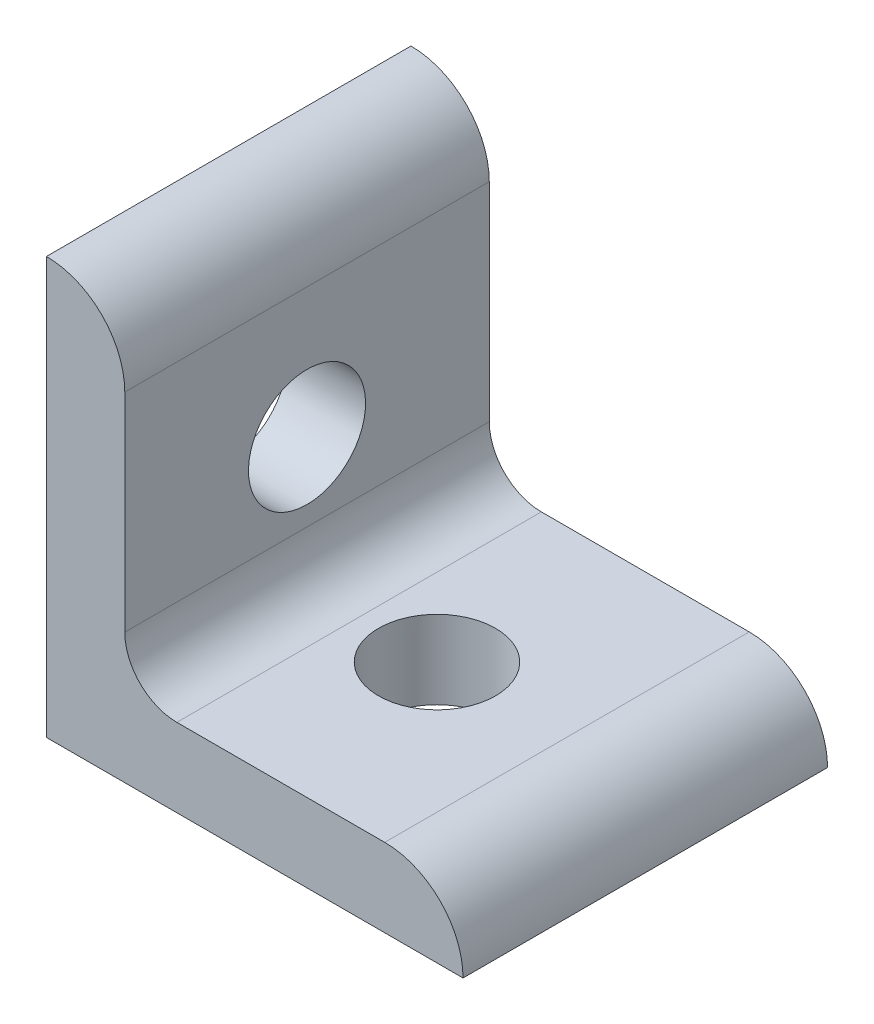
ISO-10303-21;
HEADER;
FILE_DESCRIPTION(('STEP AP214'),'2;1');
FILE_NAME('part.step','',(''),(''),'','','');
FILE_SCHEMA(('AUTOMOTIVE_DESIGN { 1 0 10303 214 1 1 1 1 }'));
ENDSEC;
DATA;
#1=APPLICATION_CONTEXT('core data for automotive mechanical design processes');
#2=APPLICATION_PROTOCOL_DEFINITION('international standard','automotive_design',2000,#1);
#3=PRODUCT_CONTEXT('',#1,'mechanical');
#4=PRODUCT('Part','Part','',(#3));
#5=PRODUCT_RELATED_PRODUCT_CATEGORY('part','',(#4));
#6=PRODUCT_DEFINITION_FORMATION('','',#4);
#7=PRODUCT_DEFINITION_CONTEXT('part definition',#1,'design');
#8=PRODUCT_DEFINITION('design','',#6,#7);
#9=PRODUCT_DEFINITION_SHAPE('','',#8);
#10=(LENGTH_UNIT() NAMED_UNIT(*) SI_UNIT(.MILLI.,.METRE.));
#11=(NAMED_UNIT(*) PLANE_ANGLE_UNIT() SI_UNIT($,.RADIAN.));
#12=(NAMED_UNIT(*) SI_UNIT($,.STERADIAN.) SOLID_ANGLE_UNIT());
#13=UNCERTAINTY_MEASURE_WITH_UNIT(LENGTH_MEASURE(1.E-05),#10,'distance_accuracy_value','');
#14=(GEOMETRIC_REPRESENTATION_CONTEXT(3) GLOBAL_UNCERTAINTY_ASSIGNED_CONTEXT((#13)) GLOBAL_UNIT_ASSIGNED_CONTEXT((#10,
#11,#12)) REPRESENTATION_CONTEXT('',''));
#15=CARTESIAN_POINT('',(0.,0.,0.));
#16=DIRECTION('',(0.,0.,1.));
#17=DIRECTION('',(1.,0.,0.));
#18=AXIS2_PLACEMENT_3D('',#15,#16,#17);
#19=CARTESIAN_POINT('',(4.7752,20.6248,11.1125));
#20=DIRECTION('',(-1.,0.,0.));
#21=DIRECTION('',(0.,-1.,0.));
#22=AXIS2_PLACEMENT_3D('',#19,#20,#21);
#23=PLANE('',#22);
#24=DIRECTION('',(0.,1.,0.));
#25=VECTOR('',#24,1.);
#26=CARTESIAN_POINT('',(4.7752,20.6248,-11.1125));
#27=LINE('',#26,#25);
#28=CARTESIAN_POINT('',(4.7752,7.9502,-11.1125));
#29=VERTEX_POINT('',#28);
#30=CARTESIAN_POINT('',(4.7752,20.6248,-11.1125));
#31=VERTEX_POINT('',#30);
#32=EDGE_CURVE('E114',#29,#31,#27,.T.);
#33=ORIENTED_EDGE('',*,*,#32,.T.);
#34=DIRECTION('',(0.,0.,-1.));
#35=VECTOR('',#34,1.);
#36=CARTESIAN_POINT('',(4.7752,20.6248,11.1125));
#37=LINE('',#36,#35);
#38=CARTESIAN_POINT('',(4.7752,20.6248,11.1125));
#39=VERTEX_POINT('',#38);
#40=EDGE_CURVE('E111',#39,#31,#37,.T.);
#41=ORIENTED_EDGE('',*,*,#40,.F.);
#42=DIRECTION('',(0.,1.,0.));
#43=VECTOR('',#42,1.);
#44=CARTESIAN_POINT('',(4.7752,20.6248,11.1125));
#45=LINE('',#44,#43);
#46=CARTESIAN_POINT('',(4.7752,7.9502,11.1125));
#47=VERTEX_POINT('',#46);
#48=EDGE_CURVE('E100',#47,#39,#45,.T.);
#49=ORIENTED_EDGE('',*,*,#48,.F.);
#50=DIRECTION('',(0.,0.,-1.));
#51=VECTOR('',#50,1.);
#52=CARTESIAN_POINT('',(4.7752,7.9502,11.1125));
#53=LINE('',#52,#51);
#54=EDGE_CURVE('E115',#47,#29,#53,.T.);
#55=ORIENTED_EDGE('',*,*,#54,.T.);
#56=EDGE_LOOP('',(#33,#41,#49,#55));
#57=FACE_BOUND('',#56,.T.);
#58=CARTESIAN_POINT('',(4.7752,12.7,0.));
#59=DIRECTION('',(-1.,0.,0.));
#60=DIRECTION('',(0.,-1.,0.));
#61=AXIS2_PLACEMENT_3D('',#58,#59,#60);
#62=CIRCLE('',#61,3.5687);
#63=CARTESIAN_POINT('',(4.7752,9.1313,0.));
#64=VERTEX_POINT('',#63);
#65=EDGE_CURVE('E164',#64,#64,#62,.F.);
#66=ORIENTED_EDGE('',*,*,#65,.F.);
#67=EDGE_LOOP('',(#66));
#68=FACE_BOUND('',#67,.T.);
#69=ADVANCED_FACE('F32',(#57,#68),#23,.F.);
#70=CARTESIAN_POINT('',(0.,0.,11.1125));
#71=DIRECTION('',(1.,0.,0.));
#72=DIRECTION('',(0.,0.,-1.));
#73=AXIS2_PLACEMENT_3D('',#70,#71,#72);
#74=PLANE('',#73);
#75=DIRECTION('',(0.,-1.,0.));
#76=VECTOR('',#75,1.);
#77=CARTESIAN_POINT('',(0.,0.,-11.1125));
#78=LINE('',#77,#76);
#79=CARTESIAN_POINT('',(0.,25.4,-11.1125));
#80=VERTEX_POINT('',#79);
#81=CARTESIAN_POINT('',(0.,0.,-11.1125));
#82=VERTEX_POINT('',#81);
#83=EDGE_CURVE('E82',#80,#82,#78,.T.);
#84=ORIENTED_EDGE('',*,*,#83,.T.);
#85=DIRECTION('',(0.,0.,-1.));
#86=VECTOR('',#85,1.);
#87=CARTESIAN_POINT('',(0.,0.,11.1125));
#88=LINE('',#87,#86);
#89=CARTESIAN_POINT('',(0.,0.,11.1125));
#90=VERTEX_POINT('',#89);
#91=EDGE_CURVE('E120',#90,#82,#88,.T.);
#92=ORIENTED_EDGE('',*,*,#91,.F.);
#93=DIRECTION('',(0.,-1.,0.));
#94=VECTOR('',#93,1.);
#95=CARTESIAN_POINT('',(0.,0.,11.1125));
#96=LINE('',#95,#94);
#97=CARTESIAN_POINT('',(0.,25.4,11.1125));
#98=VERTEX_POINT('',#97);
#99=EDGE_CURVE('E50',#98,#90,#96,.T.);
#100=ORIENTED_EDGE('',*,*,#99,.F.);
#101=DIRECTION('',(0.,0.,-1.));
#102=VECTOR('',#101,1.);
#103=CARTESIAN_POINT('',(0.,25.4,11.1125));
#104=LINE('',#103,#102);
#105=EDGE_CURVE('E116',#98,#80,#104,.T.);
#106=ORIENTED_EDGE('',*,*,#105,.T.);
#107=EDGE_LOOP('',(#84,#92,#100,#106));
#108=FACE_BOUND('',#107,.T.);
#109=CARTESIAN_POINT('',(0.,12.7,0.));
#110=DIRECTION('',(1.,0.,0.));
#111=DIRECTION('',(0.,0.,-1.));
#112=AXIS2_PLACEMENT_3D('',#109,#110,#111);
#113=CIRCLE('',#112,3.5687);
#114=CARTESIAN_POINT('',(0.,12.7,-3.5687));
#115=VERTEX_POINT('',#114);
#116=EDGE_CURVE('E167',#115,#115,#113,.T.);
#117=ORIENTED_EDGE('',*,*,#116,.T.);
#118=EDGE_LOOP('',(#117));
#119=FACE_BOUND('',#118,.T.);
#120=ADVANCED_FACE('F171',(#108,#119),#74,.F.);
#121=CARTESIAN_POINT('',(25.4,0.,11.1125));
#122=DIRECTION('',(0.,1.,0.));
#123=DIRECTION('',(-1.,0.,0.));
#124=AXIS2_PLACEMENT_3D('',#121,#122,#123);
#125=PLANE('',#124);
#126=DIRECTION('',(1.,0.,0.));
#127=VECTOR('',#126,1.);
#128=CARTESIAN_POINT('',(25.4,0.,-11.1125));
#129=LINE('',#128,#127);
#130=CARTESIAN_POINT('',(25.4,0.,-11.1125));
#131=VERTEX_POINT('',#130);
#132=EDGE_CURVE('E124',#82,#131,#129,.T.);
#133=ORIENTED_EDGE('',*,*,#132,.T.);
#134=DIRECTION('',(0.,0.,-1.));
#135=VECTOR('',#134,1.);
#136=CARTESIAN_POINT('',(25.4,0.,11.1125));
#137=LINE('',#136,#135);
#138=CARTESIAN_POINT('',(25.4,0.,11.1125));
#139=VERTEX_POINT('',#138);
#140=EDGE_CURVE('E11',#139,#131,#137,.T.);
#141=ORIENTED_EDGE('',*,*,#140,.F.);
#142=DIRECTION('',(1.,0.,0.));
#143=VECTOR('',#142,1.);
#144=CARTESIAN_POINT('',(25.4,0.,11.1125));
#145=LINE('',#144,#143);
#146=EDGE_CURVE('E136',#90,#139,#145,.T.);
#147=ORIENTED_EDGE('',*,*,#146,.F.);
#148=ORIENTED_EDGE('',*,*,#91,.T.);
#149=EDGE_LOOP('',(#133,#141,#147,#148));
#150=FACE_BOUND('',#149,.T.);
#151=CARTESIAN_POINT('',(12.7,0.,0.));
#152=DIRECTION('',(0.,1.,0.));
#153=DIRECTION('',(0.,0.,1.));
#154=AXIS2_PLACEMENT_3D('',#151,#152,#153);
#155=CIRCLE('',#154,3.5687);
#156=CARTESIAN_POINT('',(12.7,0.,3.5687));
#157=VERTEX_POINT('',#156);
#158=EDGE_CURVE('E161',#157,#157,#155,.T.);
#159=ORIENTED_EDGE('',*,*,#158,.T.);
#160=EDGE_LOOP('',(#159));
#161=FACE_BOUND('',#160,.T.);
#162=ADVANCED_FACE('F34',(#150,#161),#125,.F.);
#163=CARTESIAN_POINT('',(7.9502,4.7752,11.1125));
#164=DIRECTION('',(0.,-1.,0.));
#165=DIRECTION('',(1.,0.,0.));
#166=AXIS2_PLACEMENT_3D('',#163,#164,#165);
#167=PLANE('',#166);
#168=DIRECTION('',(-1.,0.,0.));
#169=VECTOR('',#168,1.);
#170=CARTESIAN_POINT('',(7.9502,4.7752,-11.1125));
#171=LINE('',#170,#169);
#172=CARTESIAN_POINT('',(20.6248,4.7752,-11.1125));
#173=VERTEX_POINT('',#172);
#174=CARTESIAN_POINT('',(7.9502,4.7752,-11.1125));
#175=VERTEX_POINT('',#174);
#176=EDGE_CURVE('E129',#173,#175,#171,.T.);
#177=ORIENTED_EDGE('',*,*,#176,.T.);
#178=DIRECTION('',(0.,0.,-1.));
#179=VECTOR('',#178,1.);
#180=CARTESIAN_POINT('',(7.9502,4.7752,11.1125));
#181=LINE('',#180,#179);
#182=CARTESIAN_POINT('',(7.9502,4.7752,11.1125));
#183=VERTEX_POINT('',#182);
#184=EDGE_CURVE('E140',#183,#175,#181,.T.);
#185=ORIENTED_EDGE('',*,*,#184,.F.);
#186=DIRECTION('',(-1.,0.,0.));
#187=VECTOR('',#186,1.);
#188=CARTESIAN_POINT('',(7.9502,4.7752,11.1125));
#189=LINE('',#188,#187);
#190=CARTESIAN_POINT('',(20.6248,4.7752,11.1125));
#191=VERTEX_POINT('',#190);
#192=EDGE_CURVE('E150',#191,#183,#189,.T.);
#193=ORIENTED_EDGE('',*,*,#192,.F.);
#194=DIRECTION('',(0.,0.,-1.));
#195=VECTOR('',#194,1.);
#196=CARTESIAN_POINT('',(20.6248,4.7752,11.1125));
#197=LINE('',#196,#195);
#198=EDGE_CURVE('E42',#191,#173,#197,.T.);
#199=ORIENTED_EDGE('',*,*,#198,.T.);
#200=EDGE_LOOP('',(#177,#185,#193,#199));
#201=FACE_BOUND('',#200,.T.);
#202=CARTESIAN_POINT('',(12.7,4.7752,0.));
#203=DIRECTION('',(0.,-1.,0.));
#204=DIRECTION('',(1.,0.,0.));
#205=AXIS2_PLACEMENT_3D('',#202,#203,#204);
#206=CIRCLE('',#205,3.5687);
#207=CARTESIAN_POINT('',(16.2687,4.7752,0.));
#208=VERTEX_POINT('',#207);
#209=EDGE_CURVE('E36',#208,#208,#206,.F.);
#210=ORIENTED_EDGE('',*,*,#209,.F.);
#211=EDGE_LOOP('',(#210));
#212=FACE_BOUND('',#211,.T.);
#213=ADVANCED_FACE('F147',(#201,#212),#167,.F.);
#214=CARTESIAN_POINT('',(20.6248,0.,11.1125));
#215=DIRECTION('',(0.,0.,-1.));
#216=DIRECTION('',(-1.,0.,0.));
#217=AXIS2_PLACEMENT_3D('',#214,#215,#216);
#218=CYLINDRICAL_SURFACE('',#217,4.7752);
#219=CARTESIAN_POINT('',(20.6248,0.,-11.1125));
#220=DIRECTION('',(0.,0.,1.));
#221=DIRECTION('',(1.,0.,0.));
#222=AXIS2_PLACEMENT_3D('',#219,#220,#221);
#223=CIRCLE('',#222,4.7752);
#224=EDGE_CURVE('E127',#131,#173,#223,.T.);
#225=ORIENTED_EDGE('',*,*,#224,.T.);
#226=ORIENTED_EDGE('',*,*,#198,.F.);
#227=CARTESIAN_POINT('',(20.6248,0.,11.1125));
#228=DIRECTION('',(0.,0.,1.));
#229=DIRECTION('',(1.,0.,0.));
#230=AXIS2_PLACEMENT_3D('',#227,#228,#229);
#231=CIRCLE('',#230,4.7752);
#232=EDGE_CURVE('E90',#139,#191,#231,.T.);
#233=ORIENTED_EDGE('',*,*,#232,.F.);
#234=ORIENTED_EDGE('',*,*,#140,.T.);
#235=EDGE_LOOP('',(#225,#226,#233,#234));
#236=FACE_BOUND('',#235,.T.);
#237=ADVANCED_FACE('F189',(#236),#218,.T.);
#238=CARTESIAN_POINT('',(7.9502,7.9502,11.1125));
#239=DIRECTION('',(0.,0.,-1.));
#240=DIRECTION('',(-1.,0.,0.));
#241=AXIS2_PLACEMENT_3D('',#238,#239,#240);
#242=CYLINDRICAL_SURFACE('',#241,3.175);
#243=CARTESIAN_POINT('',(7.9502,7.9502,-11.1125));
#244=DIRECTION('',(0.,0.,-1.));
#245=DIRECTION('',(1.,0.,0.));
#246=AXIS2_PLACEMENT_3D('',#243,#244,#245);
#247=CIRCLE('',#246,3.175);
#248=EDGE_CURVE('E131',#175,#29,#247,.T.);
#249=ORIENTED_EDGE('',*,*,#248,.T.);
#250=ORIENTED_EDGE('',*,*,#54,.F.);
#251=CARTESIAN_POINT('',(7.9502,7.9502,11.1125));
#252=DIRECTION('',(0.,0.,-1.));
#253=DIRECTION('',(1.,0.,0.));
#254=AXIS2_PLACEMENT_3D('',#251,#252,#253);
#255=CIRCLE('',#254,3.175);
#256=EDGE_CURVE('E106',#183,#47,#255,.T.);
#257=ORIENTED_EDGE('',*,*,#256,.F.);
#258=ORIENTED_EDGE('',*,*,#184,.T.);
#259=EDGE_LOOP('',(#249,#250,#257,#258));
#260=FACE_BOUND('',#259,.T.);
#261=ADVANCED_FACE('F156',(#260),#242,.F.);
#262=CARTESIAN_POINT('',(0.,20.6248,11.1125));
#263=DIRECTION('',(0.,0.,-1.));
#264=DIRECTION('',(-1.,0.,0.));
#265=AXIS2_PLACEMENT_3D('',#262,#263,#264);
#266=CYLINDRICAL_SURFACE('',#265,4.77520000000001);
#267=CARTESIAN_POINT('',(0.,20.6248,-11.1125));
#268=DIRECTION('',(0.,0.,1.));
#269=DIRECTION('',(1.,0.,0.));
#270=AXIS2_PLACEMENT_3D('',#267,#268,#269);
#271=CIRCLE('',#270,4.77520000000001);
#272=EDGE_CURVE('E76',#31,#80,#271,.T.);
#273=ORIENTED_EDGE('',*,*,#272,.T.);
#274=ORIENTED_EDGE('',*,*,#105,.F.);
#275=CARTESIAN_POINT('',(0.,20.6248,11.1125));
#276=DIRECTION('',(0.,0.,1.));
#277=DIRECTION('',(1.,0.,0.));
#278=AXIS2_PLACEMENT_3D('',#275,#276,#277);
#279=CIRCLE('',#278,4.77520000000001);
#280=EDGE_CURVE('E104',#39,#98,#279,.T.);
#281=ORIENTED_EDGE('',*,*,#280,.F.);
#282=ORIENTED_EDGE('',*,*,#40,.T.);
#283=EDGE_LOOP('',(#273,#274,#281,#282));
#284=FACE_BOUND('',#283,.T.);
#285=ADVANCED_FACE('F118',(#284),#266,.T.);
#286=CARTESIAN_POINT('',(0.,20.6248,11.1125));
#287=DIRECTION('',(0.,0.,1.));
#288=DIRECTION('',(1.,0.,0.));
#289=AXIS2_PLACEMENT_3D('',#286,#287,#288);
#290=PLANE('',#289);
#291=ORIENTED_EDGE('',*,*,#146,.T.);
#292=ORIENTED_EDGE('',*,*,#232,.T.);
#293=ORIENTED_EDGE('',*,*,#192,.T.);
#294=ORIENTED_EDGE('',*,*,#256,.T.);
#295=ORIENTED_EDGE('',*,*,#48,.T.);
#296=ORIENTED_EDGE('',*,*,#280,.T.);
#297=ORIENTED_EDGE('',*,*,#99,.T.);
#298=EDGE_LOOP('',(#291,#292,#293,#294,#295,#296,#297));
#299=FACE_BOUND('',#298,.T.);
#300=ADVANCED_FACE('F102',(#299),#290,.T.);
#301=CARTESIAN_POINT('',(0.,20.6248,-11.1125));
#302=DIRECTION('',(0.,0.,1.));
#303=DIRECTION('',(1.,0.,0.));
#304=AXIS2_PLACEMENT_3D('',#301,#302,#303);
#305=PLANE('',#304);
#306=ORIENTED_EDGE('',*,*,#132,.F.);
#307=ORIENTED_EDGE('',*,*,#83,.F.);
#308=ORIENTED_EDGE('',*,*,#272,.F.);
#309=ORIENTED_EDGE('',*,*,#32,.F.);
#310=ORIENTED_EDGE('',*,*,#248,.F.);
#311=ORIENTED_EDGE('',*,*,#176,.F.);
#312=ORIENTED_EDGE('',*,*,#224,.F.);
#313=EDGE_LOOP('',(#306,#307,#308,#309,#310,#311,#312));
#314=FACE_BOUND('',#313,.T.);
#315=ADVANCED_FACE('F154',(#314),#305,.F.);
#316=CARTESIAN_POINT('',(12.7,25.4,0.));
#317=DIRECTION('',(0.,-1.,0.));
#318=DIRECTION('',(0.,0.,-1.));
#319=AXIS2_PLACEMENT_3D('',#316,#317,#318);
#320=CYLINDRICAL_SURFACE('',#319,3.5687);
#321=ORIENTED_EDGE('',*,*,#158,.F.);
#322=EDGE_LOOP('',(#321));
#323=FACE_BOUND('',#322,.T.);
#324=ORIENTED_EDGE('',*,*,#209,.T.);
#325=EDGE_LOOP('',(#324));
#326=FACE_BOUND('',#325,.T.);
#327=ADVANCED_FACE('F176',(#323,#326),#320,.F.);
#328=CARTESIAN_POINT('',(25.4,12.7,0.));
#329=DIRECTION('',(-1.,0.,0.));
#330=DIRECTION('',(0.,0.,1.));
#331=AXIS2_PLACEMENT_3D('',#328,#329,#330);
#332=CYLINDRICAL_SURFACE('',#331,3.5687);
#333=ORIENTED_EDGE('',*,*,#116,.F.);
#334=EDGE_LOOP('',(#333));
#335=FACE_BOUND('',#334,.T.);
#336=ORIENTED_EDGE('',*,*,#65,.T.);
#337=EDGE_LOOP('',(#336));
#338=FACE_BOUND('',#337,.T.);
#339=ADVANCED_FACE('F173',(#335,#338),#332,.F.);
#340=CLOSED_SHELL('',(#69,#120,#162,#213,#237,#261,#285,#300,#315,#327,#339));
#341=MANIFOLD_SOLID_BREP('B2',#340);
#342=ADVANCED_BREP_SHAPE_REPRESENTATION('',(#18,#341),#14);
#343=SHAPE_DEFINITION_REPRESENTATION(#9,#342);
ENDSEC;
END-ISO-10303-21;
